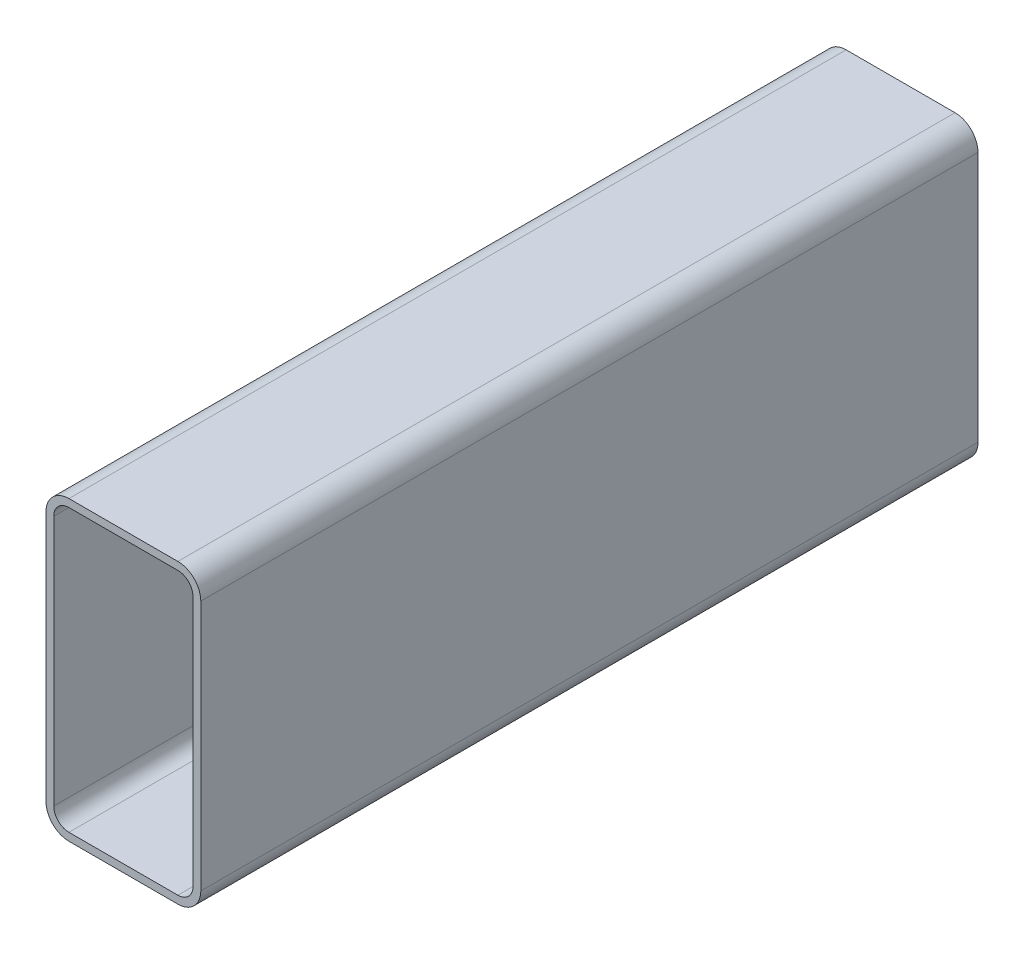
ISO-10303-21;
HEADER;
FILE_DESCRIPTION(('STEP AP214'),'2;1');
FILE_NAME('part.step','',(''),(''),'','','');
FILE_SCHEMA(('AUTOMOTIVE_DESIGN { 1 0 10303 214 1 1 1 1 }'));
ENDSEC;
DATA;
#1=APPLICATION_CONTEXT('core data for automotive mechanical design processes');
#2=APPLICATION_PROTOCOL_DEFINITION('international standard','automotive_design',2000,#1);
#3=PRODUCT_CONTEXT('',#1,'mechanical');
#4=PRODUCT('Part','Part','',(#3));
#5=PRODUCT_RELATED_PRODUCT_CATEGORY('part','',(#4));
#6=PRODUCT_DEFINITION_FORMATION('','',#4);
#7=PRODUCT_DEFINITION_CONTEXT('part definition',#1,'design');
#8=PRODUCT_DEFINITION('design','',#6,#7);
#9=PRODUCT_DEFINITION_SHAPE('','',#8);
#10=(LENGTH_UNIT() NAMED_UNIT(*) SI_UNIT(.MILLI.,.METRE.));
#11=(NAMED_UNIT(*) PLANE_ANGLE_UNIT() SI_UNIT($,.RADIAN.));
#12=(NAMED_UNIT(*) SI_UNIT($,.STERADIAN.) SOLID_ANGLE_UNIT());
#13=UNCERTAINTY_MEASURE_WITH_UNIT(LENGTH_MEASURE(1.E-05),#10,'distance_accuracy_value','');
#14=(GEOMETRIC_REPRESENTATION_CONTEXT(3) GLOBAL_UNCERTAINTY_ASSIGNED_CONTEXT((#13)) GLOBAL_UNIT_ASSIGNED_CONTEXT((#10,
#11,#12)) REPRESENTATION_CONTEXT('',''));
#15=CARTESIAN_POINT('',(0.,0.,0.));
#16=DIRECTION('',(0.,0.,1.));
#17=DIRECTION('',(1.,0.,0.));
#18=AXIS2_PLACEMENT_3D('',#15,#16,#17);
#19=CARTESIAN_POINT('',(-30.353,-58.2041,-152.4));
#20=DIRECTION('',(0.,0.,1.));
#21=DIRECTION('',(1.,0.,0.));
#22=AXIS2_PLACEMENT_3D('',#19,#20,#21);
#23=PLANE('',#22);
#24=DIRECTION('',(0.,1.,0.));
#25=VECTOR('',#24,1.);
#26=CARTESIAN_POINT('',(-27.305,0.,-152.4));
#27=LINE('',#26,#25);
#28=CARTESIAN_POINT('',(-27.305,-49.2125000005341,-152.4));
#29=VERTEX_POINT('',#28);
#30=CARTESIAN_POINT('',(-27.305,49.2124999999996,-152.4));
#31=VERTEX_POINT('',#30);
#32=EDGE_CURVE('E158',#29,#31,#27,.T.);
#33=ORIENTED_EDGE('',*,*,#32,.F.);
#34=CARTESIAN_POINT('',(-21.3614,-49.2125000000007,-152.4));
#35=DIRECTION('',(0.,0.,-1.));
#36=DIRECTION('',(0.,1.,0.));
#37=AXIS2_PLACEMENT_3D('',#34,#35,#36);
#38=CIRCLE('',#37,5.9436);
#39=CARTESIAN_POINT('',(-21.3613999988568,-55.1561,-152.4));
#40=VERTEX_POINT('',#39);
#41=EDGE_CURVE('E209',#40,#29,#38,.T.);
#42=ORIENTED_EDGE('',*,*,#41,.F.);
#43=DIRECTION('',(-1.,0.,0.));
#44=VECTOR('',#43,1.);
#45=CARTESIAN_POINT('',(0.,-55.1561,-152.4));
#46=LINE('',#45,#44);
#47=CARTESIAN_POINT('',(21.3614,-55.1561,-152.4));
#48=VERTEX_POINT('',#47);
#49=EDGE_CURVE('E154',#48,#40,#46,.T.);
#50=ORIENTED_EDGE('',*,*,#49,.F.);
#51=CARTESIAN_POINT('',(21.3614,-49.2125000000007,-152.4));
#52=DIRECTION('',(0.,0.,-1.));
#53=DIRECTION('',(0.,1.,0.));
#54=AXIS2_PLACEMENT_3D('',#51,#52,#53);
#55=CIRCLE('',#54,5.9436);
#56=CARTESIAN_POINT('',(27.305,-49.2125000012194,-152.4));
#57=VERTEX_POINT('',#56);
#58=EDGE_CURVE('E213',#57,#48,#55,.T.);
#59=ORIENTED_EDGE('',*,*,#58,.F.);
#60=DIRECTION('',(0.,-1.,0.));
#61=VECTOR('',#60,1.);
#62=CARTESIAN_POINT('',(27.305,0.,-152.4));
#63=LINE('',#62,#61);
#64=CARTESIAN_POINT('',(27.305,49.2124999999996,-152.4));
#65=VERTEX_POINT('',#64);
#66=EDGE_CURVE('E163',#65,#57,#63,.T.);
#67=ORIENTED_EDGE('',*,*,#66,.F.);
#68=CARTESIAN_POINT('',(21.3614,49.2124999999993,-152.4));
#69=DIRECTION('',(0.,0.,-1.));
#70=DIRECTION('',(0.,1.,0.));
#71=AXIS2_PLACEMENT_3D('',#68,#69,#70);
#72=CIRCLE('',#71,5.9436);
#73=CARTESIAN_POINT('',(21.3614000006095,55.1561,-152.4));
#74=VERTEX_POINT('',#73);
#75=EDGE_CURVE('E216',#74,#65,#72,.T.);
#76=ORIENTED_EDGE('',*,*,#75,.F.);
#77=DIRECTION('',(1.,0.,0.));
#78=VECTOR('',#77,1.);
#79=CARTESIAN_POINT('',(0.,55.1561,-152.4));
#80=LINE('',#79,#78);
#81=CARTESIAN_POINT('',(-21.3614,55.1561,-152.4));
#82=VERTEX_POINT('',#81);
#83=EDGE_CURVE('E168',#82,#74,#80,.T.);
#84=ORIENTED_EDGE('',*,*,#83,.F.);
#85=CARTESIAN_POINT('',(-21.3614,49.2124999999993,-152.4));
#86=DIRECTION('',(0.,0.,-1.));
#87=DIRECTION('',(0.,1.,0.));
#88=AXIS2_PLACEMENT_3D('',#85,#86,#87);
#89=CIRCLE('',#88,5.9436);
#90=EDGE_CURVE('E161',#31,#82,#89,.T.);
#91=ORIENTED_EDGE('',*,*,#90,.F.);
#92=EDGE_LOOP('',(#33,#42,#50,#59,#67,#76,#84,#91));
#93=FACE_BOUND('',#92,.T.);
#94=DIRECTION('',(0.,-1.,0.));
#95=VECTOR('',#94,1.);
#96=CARTESIAN_POINT('',(30.353,0.,-152.4));
#97=LINE('',#96,#95);
#98=CARTESIAN_POINT('',(30.353,49.2124999999998,-152.4));
#99=VERTEX_POINT('',#98);
#100=CARTESIAN_POINT('',(30.353,-49.2125000000002,-152.4));
#101=VERTEX_POINT('',#100);
#102=EDGE_CURVE('E162',#99,#101,#97,.T.);
#103=ORIENTED_EDGE('',*,*,#102,.T.);
#104=CARTESIAN_POINT('',(21.3614,-49.2125000000005,-152.4));
#105=DIRECTION('',(0.,0.,-1.));
#106=DIRECTION('',(0.,1.,0.));
#107=AXIS2_PLACEMENT_3D('',#104,#105,#106);
#108=CIRCLE('',#107,8.9916);
#109=CARTESIAN_POINT('',(21.3614000017295,-58.2041,-152.4));
#110=VERTEX_POINT('',#109);
#111=EDGE_CURVE('E221',#101,#110,#108,.T.);
#112=ORIENTED_EDGE('',*,*,#111,.T.);
#113=DIRECTION('',(-1.,0.,0.));
#114=VECTOR('',#113,1.);
#115=CARTESIAN_POINT('',(0.,-58.2041,-152.4));
#116=LINE('',#115,#114);
#117=CARTESIAN_POINT('',(-21.3614,-58.2041,-152.4));
#118=VERTEX_POINT('',#117);
#119=EDGE_CURVE('E174',#110,#118,#116,.T.);
#120=ORIENTED_EDGE('',*,*,#119,.T.);
#121=CARTESIAN_POINT('',(-21.3614,-49.2125000000005,-152.4));
#122=DIRECTION('',(0.,0.,-1.));
#123=DIRECTION('',(0.,1.,0.));
#124=AXIS2_PLACEMENT_3D('',#121,#122,#123);
#125=CIRCLE('',#124,8.9916);
#126=CARTESIAN_POINT('',(-30.353,-49.2125000008076,-152.4));
#127=VERTEX_POINT('',#126);
#128=EDGE_CURVE('E225',#118,#127,#125,.T.);
#129=ORIENTED_EDGE('',*,*,#128,.T.);
#130=DIRECTION('',(0.,1.,0.));
#131=VECTOR('',#130,1.);
#132=CARTESIAN_POINT('',(-30.353,0.,-152.4));
#133=LINE('',#132,#131);
#134=CARTESIAN_POINT('',(-30.353,49.2124999999998,-152.4));
#135=VERTEX_POINT('',#134);
#136=EDGE_CURVE('E179',#127,#135,#133,.T.);
#137=ORIENTED_EDGE('',*,*,#136,.T.);
#138=CARTESIAN_POINT('',(-21.3614,49.2124999999995,-152.4));
#139=DIRECTION('',(0.,0.,-1.));
#140=DIRECTION('',(0.,1.,0.));
#141=AXIS2_PLACEMENT_3D('',#138,#139,#140);
#142=CIRCLE('',#141,8.9916);
#143=CARTESIAN_POINT('',(-21.3613999990779,58.2041,-152.4));
#144=VERTEX_POINT('',#143);
#145=EDGE_CURVE('E141',#135,#144,#142,.T.);
#146=ORIENTED_EDGE('',*,*,#145,.T.);
#147=DIRECTION('',(1.,0.,0.));
#148=VECTOR('',#147,1.);
#149=CARTESIAN_POINT('',(0.,58.2041,-152.4));
#150=LINE('',#149,#148);
#151=CARTESIAN_POINT('',(21.3614,58.2041,-152.4));
#152=VERTEX_POINT('',#151);
#153=EDGE_CURVE('E139',#144,#152,#150,.T.);
#154=ORIENTED_EDGE('',*,*,#153,.T.);
#155=CARTESIAN_POINT('',(21.3614,49.2124999999995,-152.4));
#156=DIRECTION('',(0.,0.,-1.));
#157=DIRECTION('',(0.,1.,0.));
#158=AXIS2_PLACEMENT_3D('',#155,#156,#157);
#159=CIRCLE('',#158,8.9916);
#160=EDGE_CURVE('E20',#152,#99,#159,.T.);
#161=ORIENTED_EDGE('',*,*,#160,.T.);
#162=EDGE_LOOP('',(#103,#112,#120,#129,#137,#146,#154,#161));
#163=FACE_BOUND('',#162,.T.);
#164=ADVANCED_FACE('F16',(#93,#163),#23,.F.);
#165=CARTESIAN_POINT('',(21.3614,49.2125,152.4));
#166=DIRECTION('',(0.,0.,-1.));
#167=DIRECTION('',(0.,1.,0.));
#168=AXIS2_PLACEMENT_3D('',#165,#166,#167);
#169=CYLINDRICAL_SURFACE('',#168,8.9916);
#170=DIRECTION('',(0.,0.,1.));
#171=VECTOR('',#170,1.);
#172=CARTESIAN_POINT('',(21.3614,58.2041,0.));
#173=LINE('',#172,#171);
#174=CARTESIAN_POINT('',(21.3614,58.2041,152.4));
#175=VERTEX_POINT('',#174);
#176=EDGE_CURVE('E131',#152,#175,#173,.T.);
#177=ORIENTED_EDGE('',*,*,#176,.T.);
#178=CARTESIAN_POINT('',(21.3614,49.2125,152.4));
#179=DIRECTION('',(0.,0.,-1.));
#180=DIRECTION('',(0.,1.,0.));
#181=AXIS2_PLACEMENT_3D('',#178,#179,#180);
#182=CIRCLE('',#181,8.9916);
#183=CARTESIAN_POINT('',(30.353,49.2125,152.4));
#184=VERTEX_POINT('',#183);
#185=EDGE_CURVE('E207',#184,#175,#182,.F.);
#186=ORIENTED_EDGE('',*,*,#185,.F.);
#187=DIRECTION('',(0.,0.,-1.));
#188=VECTOR('',#187,1.);
#189=CARTESIAN_POINT('',(30.353,49.2125,0.));
#190=LINE('',#189,#188);
#191=EDGE_CURVE('E134',#184,#99,#190,.T.);
#192=ORIENTED_EDGE('',*,*,#191,.T.);
#193=ORIENTED_EDGE('',*,*,#160,.F.);
#194=EDGE_LOOP('',(#177,#186,#192,#193));
#195=FACE_BOUND('',#194,.T.);
#196=ADVANCED_FACE('F129',(#195),#169,.T.);
#197=CARTESIAN_POINT('',(-21.3614,58.2041,152.4));
#198=DIRECTION('',(0.,-1.,0.));
#199=DIRECTION('',(0.,0.,-1.));
#200=AXIS2_PLACEMENT_3D('',#197,#198,#199);
#201=PLANE('',#200);
#202=DIRECTION('',(0.,0.,-1.));
#203=VECTOR('',#202,1.);
#204=CARTESIAN_POINT('',(-21.3613999981558,58.2041,0.));
#205=LINE('',#204,#203);
#206=CARTESIAN_POINT('',(-21.3613999990779,58.2041,152.4));
#207=VERTEX_POINT('',#206);
#208=EDGE_CURVE('E144',#144,#207,#205,.F.);
#209=ORIENTED_EDGE('',*,*,#208,.T.);
#210=DIRECTION('',(-1.,0.,0.));
#211=VECTOR('',#210,1.);
#212=CARTESIAN_POINT('',(0.,58.2041,152.4));
#213=LINE('',#212,#211);
#214=EDGE_CURVE('E148',#175,#207,#213,.T.);
#215=ORIENTED_EDGE('',*,*,#214,.F.);
#216=ORIENTED_EDGE('',*,*,#176,.F.);
#217=ORIENTED_EDGE('',*,*,#153,.F.);
#218=EDGE_LOOP('',(#209,#215,#216,#217));
#219=FACE_BOUND('',#218,.T.);
#220=ADVANCED_FACE('F146',(#219),#201,.F.);
#221=CARTESIAN_POINT('',(-21.3614,49.2125,152.4));
#222=DIRECTION('',(0.,0.,-1.));
#223=DIRECTION('',(0.,1.,0.));
#224=AXIS2_PLACEMENT_3D('',#221,#222,#223);
#225=CYLINDRICAL_SURFACE('',#224,8.9916);
#226=DIRECTION('',(0.,0.,1.));
#227=VECTOR('',#226,1.);
#228=CARTESIAN_POINT('',(-30.353,49.2125,0.));
#229=LINE('',#228,#227);
#230=CARTESIAN_POINT('',(-30.353,49.2125,152.4));
#231=VERTEX_POINT('',#230);
#232=EDGE_CURVE('E181',#135,#231,#229,.T.);
#233=ORIENTED_EDGE('',*,*,#232,.T.);
#234=CARTESIAN_POINT('',(-21.3614,49.2125,152.4));
#235=DIRECTION('',(0.,0.,-1.));
#236=DIRECTION('',(0.,1.,0.));
#237=AXIS2_PLACEMENT_3D('',#234,#235,#236);
#238=CIRCLE('',#237,8.9916);
#239=EDGE_CURVE('E204',#207,#231,#238,.F.);
#240=ORIENTED_EDGE('',*,*,#239,.F.);
#241=ORIENTED_EDGE('',*,*,#208,.F.);
#242=ORIENTED_EDGE('',*,*,#145,.F.);
#243=EDGE_LOOP('',(#233,#240,#241,#242));
#244=FACE_BOUND('',#243,.T.);
#245=ADVANCED_FACE('F229',(#244),#225,.T.);
#246=CARTESIAN_POINT('',(-30.353,-49.2125,152.4));
#247=DIRECTION('',(1.,0.,0.));
#248=DIRECTION('',(0.,0.,-1.));
#249=AXIS2_PLACEMENT_3D('',#246,#247,#248);
#250=PLANE('',#249);
#251=DIRECTION('',(0.,0.,-1.));
#252=VECTOR('',#251,1.);
#253=CARTESIAN_POINT('',(-30.353,-49.2125000016148,0.));
#254=LINE('',#253,#252);
#255=CARTESIAN_POINT('',(-30.353,-49.2125000008074,152.4));
#256=VERTEX_POINT('',#255);
#257=EDGE_CURVE('E180',#127,#256,#254,.F.);
#258=ORIENTED_EDGE('',*,*,#257,.T.);
#259=DIRECTION('',(0.,-1.,0.));
#260=VECTOR('',#259,1.);
#261=CARTESIAN_POINT('',(-30.353,0.,152.4));
#262=LINE('',#261,#260);
#263=EDGE_CURVE('E203',#231,#256,#262,.T.);
#264=ORIENTED_EDGE('',*,*,#263,.F.);
#265=ORIENTED_EDGE('',*,*,#232,.F.);
#266=ORIENTED_EDGE('',*,*,#136,.F.);
#267=EDGE_LOOP('',(#258,#264,#265,#266));
#268=FACE_BOUND('',#267,.T.);
#269=ADVANCED_FACE('F261',(#268),#250,.F.);
#270=CARTESIAN_POINT('',(-21.3614,-49.2125,152.4));
#271=DIRECTION('',(0.,0.,-1.));
#272=DIRECTION('',(0.,1.,0.));
#273=AXIS2_PLACEMENT_3D('',#270,#271,#272);
#274=CYLINDRICAL_SURFACE('',#273,8.9916);
#275=DIRECTION('',(0.,0.,1.));
#276=VECTOR('',#275,1.);
#277=CARTESIAN_POINT('',(-21.3614,-58.2041,0.));
#278=LINE('',#277,#276);
#279=CARTESIAN_POINT('',(-21.3614,-58.2041,152.4));
#280=VERTEX_POINT('',#279);
#281=EDGE_CURVE('E178',#118,#280,#278,.T.);
#282=ORIENTED_EDGE('',*,*,#281,.T.);
#283=CARTESIAN_POINT('',(-21.3614,-49.2125,152.4));
#284=DIRECTION('',(0.,0.,-1.));
#285=DIRECTION('',(0.,1.,0.));
#286=AXIS2_PLACEMENT_3D('',#283,#284,#285);
#287=CIRCLE('',#286,8.9916);
#288=EDGE_CURVE('E200',#256,#280,#287,.F.);
#289=ORIENTED_EDGE('',*,*,#288,.F.);
#290=ORIENTED_EDGE('',*,*,#257,.F.);
#291=ORIENTED_EDGE('',*,*,#128,.F.);
#292=EDGE_LOOP('',(#282,#289,#290,#291));
#293=FACE_BOUND('',#292,.T.);
#294=ADVANCED_FACE('F263',(#293),#274,.T.);
#295=CARTESIAN_POINT('',(-21.3614,-58.2041,-152.4));
#296=DIRECTION('',(0.,1.,0.));
#297=DIRECTION('',(0.,0.,1.));
#298=AXIS2_PLACEMENT_3D('',#295,#296,#297);
#299=PLANE('',#298);
#300=DIRECTION('',(0.,0.,-1.));
#301=VECTOR('',#300,1.);
#302=CARTESIAN_POINT('',(21.361400003459,-58.2041,0.));
#303=LINE('',#302,#301);
#304=CARTESIAN_POINT('',(21.3614000017295,-58.2041,152.4));
#305=VERTEX_POINT('',#304);
#306=EDGE_CURVE('E177',#110,#305,#303,.F.);
#307=ORIENTED_EDGE('',*,*,#306,.T.);
#308=DIRECTION('',(1.,0.,0.));
#309=VECTOR('',#308,1.);
#310=CARTESIAN_POINT('',(0.,-58.2041,152.4));
#311=LINE('',#310,#309);
#312=EDGE_CURVE('E199',#280,#305,#311,.T.);
#313=ORIENTED_EDGE('',*,*,#312,.F.);
#314=ORIENTED_EDGE('',*,*,#281,.F.);
#315=ORIENTED_EDGE('',*,*,#119,.F.);
#316=EDGE_LOOP('',(#307,#313,#314,#315));
#317=FACE_BOUND('',#316,.T.);
#318=ADVANCED_FACE('F319',(#317),#299,.F.);
#319=CARTESIAN_POINT('',(21.3614,-49.2125,152.4));
#320=DIRECTION('',(0.,0.,-1.));
#321=DIRECTION('',(0.,1.,0.));
#322=AXIS2_PLACEMENT_3D('',#319,#320,#321);
#323=CYLINDRICAL_SURFACE('',#322,8.9916);
#324=DIRECTION('',(0.,0.,1.));
#325=VECTOR('',#324,1.);
#326=CARTESIAN_POINT('',(30.353,-49.2125,0.));
#327=LINE('',#326,#325);
#328=CARTESIAN_POINT('',(30.353,-49.2125,152.4));
#329=VERTEX_POINT('',#328);
#330=EDGE_CURVE('E224',#101,#329,#327,.T.);
#331=ORIENTED_EDGE('',*,*,#330,.T.);
#332=CARTESIAN_POINT('',(21.3614,-49.2125,152.4));
#333=DIRECTION('',(0.,0.,-1.));
#334=DIRECTION('',(0.,1.,0.));
#335=AXIS2_PLACEMENT_3D('',#332,#333,#334);
#336=CIRCLE('',#335,8.9916);
#337=EDGE_CURVE('E195',#305,#329,#336,.F.);
#338=ORIENTED_EDGE('',*,*,#337,.F.);
#339=ORIENTED_EDGE('',*,*,#306,.F.);
#340=ORIENTED_EDGE('',*,*,#111,.F.);
#341=EDGE_LOOP('',(#331,#338,#339,#340));
#342=FACE_BOUND('',#341,.T.);
#343=ADVANCED_FACE('F315',(#342),#323,.T.);
#344=CARTESIAN_POINT('',(30.353,-49.2125,-152.4));
#345=DIRECTION('',(-1.,0.,0.));
#346=DIRECTION('',(0.,0.,1.));
#347=AXIS2_PLACEMENT_3D('',#344,#345,#346);
#348=PLANE('',#347);
#349=ORIENTED_EDGE('',*,*,#191,.F.);
#350=DIRECTION('',(0.,1.,0.));
#351=VECTOR('',#350,1.);
#352=CARTESIAN_POINT('',(30.353,0.,152.4));
#353=LINE('',#352,#351);
#354=EDGE_CURVE('E198',#329,#184,#353,.T.);
#355=ORIENTED_EDGE('',*,*,#354,.F.);
#356=ORIENTED_EDGE('',*,*,#330,.F.);
#357=ORIENTED_EDGE('',*,*,#102,.F.);
#358=EDGE_LOOP('',(#349,#355,#356,#357));
#359=FACE_BOUND('',#358,.T.);
#360=ADVANCED_FACE('F318',(#359),#348,.F.);
#361=CARTESIAN_POINT('',(-27.305,-49.2125,152.4));
#362=DIRECTION('',(1.,0.,0.));
#363=DIRECTION('',(0.,0.,-1.));
#364=AXIS2_PLACEMENT_3D('',#361,#362,#363);
#365=PLANE('',#364);
#366=DIRECTION('',(0.,1.,0.));
#367=VECTOR('',#366,1.);
#368=CARTESIAN_POINT('',(-27.30500000127,0.,152.4));
#369=LINE('',#368,#367);
#370=CARTESIAN_POINT('',(-27.305000000635,-49.2125000005337,152.4));
#371=VERTEX_POINT('',#370);
#372=CARTESIAN_POINT('',(-27.305000000635,49.2125,152.4));
#373=VERTEX_POINT('',#372);
#374=EDGE_CURVE('E194',#371,#373,#369,.T.);
#375=ORIENTED_EDGE('',*,*,#374,.F.);
#376=DIRECTION('',(0.,0.,-1.));
#377=VECTOR('',#376,1.);
#378=CARTESIAN_POINT('',(-27.305,-49.2125000010674,0.));
#379=LINE('',#378,#377);
#380=EDGE_CURVE('E212',#29,#371,#379,.F.);
#381=ORIENTED_EDGE('',*,*,#380,.F.);
#382=ORIENTED_EDGE('',*,*,#32,.T.);
#383=DIRECTION('',(0.,0.,1.));
#384=VECTOR('',#383,1.);
#385=CARTESIAN_POINT('',(-27.305,49.2125,0.));
#386=LINE('',#385,#384);
#387=EDGE_CURVE('E172',#373,#31,#386,.F.);
#388=ORIENTED_EDGE('',*,*,#387,.F.);
#389=EDGE_LOOP('',(#375,#381,#382,#388));
#390=FACE_BOUND('',#389,.T.);
#391=ADVANCED_FACE('F298',(#390),#365,.T.);
#392=CARTESIAN_POINT('',(-21.3614,49.2125,152.4));
#393=DIRECTION('',(0.,0.,-1.));
#394=DIRECTION('',(0.,1.,0.));
#395=AXIS2_PLACEMENT_3D('',#392,#393,#394);
#396=CYLINDRICAL_SURFACE('',#395,5.9436);
#397=CARTESIAN_POINT('',(-21.3614,49.2125,152.4));
#398=DIRECTION('',(0.,0.,-1.));
#399=DIRECTION('',(0.,1.,0.));
#400=AXIS2_PLACEMENT_3D('',#397,#398,#399);
#401=CIRCLE('',#400,5.9436);
#402=CARTESIAN_POINT('',(-21.3614,55.1561000263398,152.4));
#403=VERTEX_POINT('',#402);
#404=EDGE_CURVE('E191',#373,#403,#401,.T.);
#405=ORIENTED_EDGE('',*,*,#404,.F.);
#406=ORIENTED_EDGE('',*,*,#387,.T.);
#407=ORIENTED_EDGE('',*,*,#90,.T.);
#408=DIRECTION('',(0.,0.,-1.));
#409=VECTOR('',#408,1.);
#410=CARTESIAN_POINT('',(-21.3614,55.1561,0.));
#411=LINE('',#410,#409);
#412=EDGE_CURVE('E171',#403,#82,#411,.T.);
#413=ORIENTED_EDGE('',*,*,#412,.F.);
#414=EDGE_LOOP('',(#405,#406,#407,#413));
#415=FACE_BOUND('',#414,.T.);
#416=ADVANCED_FACE('F295',(#415),#396,.F.);
#417=CARTESIAN_POINT('',(-21.3614,55.1561,152.4));
#418=DIRECTION('',(0.,-1.,0.));
#419=DIRECTION('',(0.,0.,-1.));
#420=AXIS2_PLACEMENT_3D('',#417,#418,#419);
#421=PLANE('',#420);
#422=DIRECTION('',(1.,0.,0.));
#423=VECTOR('',#422,1.);
#424=CARTESIAN_POINT('',(0.,55.1561000526796,152.4));
#425=LINE('',#424,#423);
#426=CARTESIAN_POINT('',(21.3614000006095,55.1561000263398,152.4));
#427=VERTEX_POINT('',#426);
#428=EDGE_CURVE('E190',#403,#427,#425,.T.);
#429=ORIENTED_EDGE('',*,*,#428,.F.);
#430=ORIENTED_EDGE('',*,*,#412,.T.);
#431=ORIENTED_EDGE('',*,*,#83,.T.);
#432=DIRECTION('',(0.,0.,1.));
#433=VECTOR('',#432,1.);
#434=CARTESIAN_POINT('',(21.3614000012191,55.1561,0.));
#435=LINE('',#434,#433);
#436=EDGE_CURVE('E167',#427,#74,#435,.F.);
#437=ORIENTED_EDGE('',*,*,#436,.F.);
#438=EDGE_LOOP('',(#429,#430,#431,#437));
#439=FACE_BOUND('',#438,.T.);
#440=ADVANCED_FACE('F292',(#439),#421,.T.);
#441=CARTESIAN_POINT('',(21.3614,49.2125,152.4));
#442=DIRECTION('',(0.,0.,-1.));
#443=DIRECTION('',(0.,1.,0.));
#444=AXIS2_PLACEMENT_3D('',#441,#442,#443);
#445=CYLINDRICAL_SURFACE('',#444,5.9436);
#446=CARTESIAN_POINT('',(21.3614,49.2125,152.4));
#447=DIRECTION('',(0.,0.,-1.));
#448=DIRECTION('',(0.,1.,0.));
#449=AXIS2_PLACEMENT_3D('',#446,#447,#448);
#450=CIRCLE('',#449,5.9436);
#451=CARTESIAN_POINT('',(27.305000000635,49.2125,152.4));
#452=VERTEX_POINT('',#451);
#453=EDGE_CURVE('E187',#427,#452,#450,.T.);
#454=ORIENTED_EDGE('',*,*,#453,.F.);
#455=ORIENTED_EDGE('',*,*,#436,.T.);
#456=ORIENTED_EDGE('',*,*,#75,.T.);
#457=DIRECTION('',(0.,0.,-1.));
#458=VECTOR('',#457,1.);
#459=CARTESIAN_POINT('',(27.305,49.2125,0.));
#460=LINE('',#459,#458);
#461=EDGE_CURVE('E166',#452,#65,#460,.T.);
#462=ORIENTED_EDGE('',*,*,#461,.F.);
#463=EDGE_LOOP('',(#454,#455,#456,#462));
#464=FACE_BOUND('',#463,.T.);
#465=ADVANCED_FACE('F289',(#464),#445,.F.);
#466=CARTESIAN_POINT('',(27.305,-49.2125,-152.4));
#467=DIRECTION('',(-1.,0.,0.));
#468=DIRECTION('',(0.,0.,1.));
#469=AXIS2_PLACEMENT_3D('',#466,#467,#468);
#470=PLANE('',#469);
#471=DIRECTION('',(0.,-1.,0.));
#472=VECTOR('',#471,1.);
#473=CARTESIAN_POINT('',(27.30500000127,0.,152.4));
#474=LINE('',#473,#472);
#475=CARTESIAN_POINT('',(27.305000000635,-49.212500001219,152.4));
#476=VERTEX_POINT('',#475);
#477=EDGE_CURVE('E186',#452,#476,#474,.T.);
#478=ORIENTED_EDGE('',*,*,#477,.F.);
#479=ORIENTED_EDGE('',*,*,#461,.T.);
#480=ORIENTED_EDGE('',*,*,#66,.T.);
#481=DIRECTION('',(0.,0.,1.));
#482=VECTOR('',#481,1.);
#483=CARTESIAN_POINT('',(27.305,-49.2125000024381,0.));
#484=LINE('',#483,#482);
#485=EDGE_CURVE('E157',#476,#57,#484,.F.);
#486=ORIENTED_EDGE('',*,*,#485,.F.);
#487=EDGE_LOOP('',(#478,#479,#480,#486));
#488=FACE_BOUND('',#487,.T.);
#489=ADVANCED_FACE('F286',(#488),#470,.T.);
#490=CARTESIAN_POINT('',(21.3614,-49.2125,152.4));
#491=DIRECTION('',(0.,0.,-1.));
#492=DIRECTION('',(0.,1.,0.));
#493=AXIS2_PLACEMENT_3D('',#490,#491,#492);
#494=CYLINDRICAL_SURFACE('',#493,5.9436);
#495=CARTESIAN_POINT('',(21.3614,-49.2125,152.4));
#496=DIRECTION('',(0.,0.,-1.));
#497=DIRECTION('',(0.,1.,0.));
#498=AXIS2_PLACEMENT_3D('',#495,#496,#497);
#499=CIRCLE('',#498,5.9436);
#500=CARTESIAN_POINT('',(21.3614,-55.1561000263398,152.4));
#501=VERTEX_POINT('',#500);
#502=EDGE_CURVE('E183',#476,#501,#499,.T.);
#503=ORIENTED_EDGE('',*,*,#502,.F.);
#504=ORIENTED_EDGE('',*,*,#485,.T.);
#505=ORIENTED_EDGE('',*,*,#58,.T.);
#506=DIRECTION('',(0.,0.,-1.));
#507=VECTOR('',#506,1.);
#508=CARTESIAN_POINT('',(21.3614,-55.1561,0.));
#509=LINE('',#508,#507);
#510=EDGE_CURVE('E156',#501,#48,#509,.T.);
#511=ORIENTED_EDGE('',*,*,#510,.F.);
#512=EDGE_LOOP('',(#503,#504,#505,#511));
#513=FACE_BOUND('',#512,.T.);
#514=ADVANCED_FACE('F282',(#513),#494,.F.);
#515=CARTESIAN_POINT('',(-21.3614,-55.1561,-152.4));
#516=DIRECTION('',(0.,1.,0.));
#517=DIRECTION('',(0.,0.,1.));
#518=AXIS2_PLACEMENT_3D('',#515,#516,#517);
#519=PLANE('',#518);
#520=DIRECTION('',(-1.,0.,0.));
#521=VECTOR('',#520,1.);
#522=CARTESIAN_POINT('',(0.,-55.1561000526796,152.4));
#523=LINE('',#522,#521);
#524=CARTESIAN_POINT('',(-21.3613999988568,-55.1561000263398,152.4));
#525=VERTEX_POINT('',#524);
#526=EDGE_CURVE('E26',#501,#525,#523,.T.);
#527=ORIENTED_EDGE('',*,*,#526,.F.);
#528=ORIENTED_EDGE('',*,*,#510,.T.);
#529=ORIENTED_EDGE('',*,*,#49,.T.);
#530=DIRECTION('',(0.,0.,1.));
#531=VECTOR('',#530,1.);
#532=CARTESIAN_POINT('',(-21.3613999977136,-55.1561,0.));
#533=LINE('',#532,#531);
#534=EDGE_CURVE('E35',#525,#40,#533,.F.);
#535=ORIENTED_EDGE('',*,*,#534,.F.);
#536=EDGE_LOOP('',(#527,#528,#529,#535));
#537=FACE_BOUND('',#536,.T.);
#538=ADVANCED_FACE('F280',(#537),#519,.T.);
#539=CARTESIAN_POINT('',(-21.3614,-49.2125,152.4));
#540=DIRECTION('',(0.,0.,-1.));
#541=DIRECTION('',(0.,1.,0.));
#542=AXIS2_PLACEMENT_3D('',#539,#540,#541);
#543=CYLINDRICAL_SURFACE('',#542,5.9436);
#544=CARTESIAN_POINT('',(-21.3614,-49.2125,152.4));
#545=DIRECTION('',(0.,0.,-1.));
#546=DIRECTION('',(0.,1.,0.));
#547=AXIS2_PLACEMENT_3D('',#544,#545,#546);
#548=CIRCLE('',#547,5.9436);
#549=EDGE_CURVE('E10',#525,#371,#548,.T.);
#550=ORIENTED_EDGE('',*,*,#549,.F.);
#551=ORIENTED_EDGE('',*,*,#534,.T.);
#552=ORIENTED_EDGE('',*,*,#41,.T.);
#553=ORIENTED_EDGE('',*,*,#380,.T.);
#554=EDGE_LOOP('',(#550,#551,#552,#553));
#555=FACE_BOUND('',#554,.T.);
#556=ADVANCED_FACE('F300',(#555),#543,.F.);
#557=CARTESIAN_POINT('',(-30.353,-58.2041,152.4));
#558=DIRECTION('',(0.,0.,1.));
#559=DIRECTION('',(1.,0.,0.));
#560=AXIS2_PLACEMENT_3D('',#557,#558,#559);
#561=PLANE('',#560);
#562=ORIENTED_EDGE('',*,*,#526,.T.);
#563=ORIENTED_EDGE('',*,*,#549,.T.);
#564=ORIENTED_EDGE('',*,*,#374,.T.);
#565=ORIENTED_EDGE('',*,*,#404,.T.);
#566=ORIENTED_EDGE('',*,*,#428,.T.);
#567=ORIENTED_EDGE('',*,*,#453,.T.);
#568=ORIENTED_EDGE('',*,*,#477,.T.);
#569=ORIENTED_EDGE('',*,*,#502,.T.);
#570=EDGE_LOOP('',(#562,#563,#564,#565,#566,#567,#568,#569));
#571=FACE_BOUND('',#570,.T.);
#572=ORIENTED_EDGE('',*,*,#337,.T.);
#573=ORIENTED_EDGE('',*,*,#354,.T.);
#574=ORIENTED_EDGE('',*,*,#185,.T.);
#575=ORIENTED_EDGE('',*,*,#214,.T.);
#576=ORIENTED_EDGE('',*,*,#239,.T.);
#577=ORIENTED_EDGE('',*,*,#263,.T.);
#578=ORIENTED_EDGE('',*,*,#288,.T.);
#579=ORIENTED_EDGE('',*,*,#312,.T.);
#580=EDGE_LOOP('',(#572,#573,#574,#575,#576,#577,#578,#579));
#581=FACE_BOUND('',#580,.T.);
#582=ADVANCED_FACE('F18',(#571,#581),#561,.T.);
#583=CLOSED_SHELL('',(#164,#196,#220,#245,#269,#294,#318,#343,#360,#391,#416,#440,#465,#489,
#514,#538,#556,#582));
#584=MANIFOLD_SOLID_BREP('B1',#583);
#585=ADVANCED_BREP_SHAPE_REPRESENTATION('',(#18,#584),#14);
#586=SHAPE_DEFINITION_REPRESENTATION(#9,#585);
ENDSEC;
END-ISO-10303-21;
